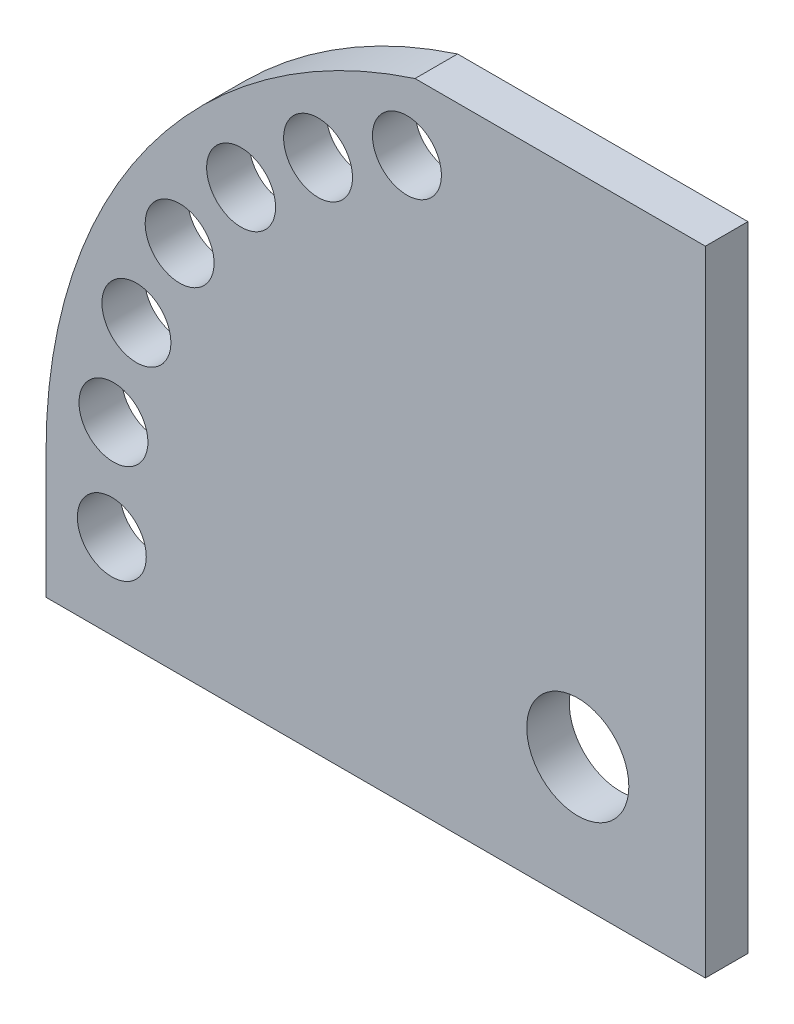
ISO-10303-21;
HEADER;
FILE_DESCRIPTION(('STEP AP214'),'2;1');
FILE_NAME('part.step','',(''),(''),'','','');
FILE_SCHEMA(('AUTOMOTIVE_DESIGN { 1 0 10303 214 1 1 1 1 }'));
ENDSEC;
DATA;
#1=APPLICATION_CONTEXT('core data for automotive mechanical design processes');
#2=APPLICATION_PROTOCOL_DEFINITION('international standard','automotive_design',2000,#1);
#3=PRODUCT_CONTEXT('',#1,'mechanical');
#4=PRODUCT('Part','Part','',(#3));
#5=PRODUCT_RELATED_PRODUCT_CATEGORY('part','',(#4));
#6=PRODUCT_DEFINITION_FORMATION('','',#4);
#7=PRODUCT_DEFINITION_CONTEXT('part definition',#1,'design');
#8=PRODUCT_DEFINITION('design','',#6,#7);
#9=PRODUCT_DEFINITION_SHAPE('','',#8);
#10=(LENGTH_UNIT() NAMED_UNIT(*) SI_UNIT(.MILLI.,.METRE.));
#11=(NAMED_UNIT(*) PLANE_ANGLE_UNIT() SI_UNIT($,.RADIAN.));
#12=(NAMED_UNIT(*) SI_UNIT($,.STERADIAN.) SOLID_ANGLE_UNIT());
#13=UNCERTAINTY_MEASURE_WITH_UNIT(LENGTH_MEASURE(1.E-05),#10,'distance_accuracy_value','');
#14=(GEOMETRIC_REPRESENTATION_CONTEXT(3) GLOBAL_UNCERTAINTY_ASSIGNED_CONTEXT((#13)) GLOBAL_UNIT_ASSIGNED_CONTEXT((#10,
#11,#12)) REPRESENTATION_CONTEXT('',''));
#15=CARTESIAN_POINT('',(0.,0.,0.));
#16=DIRECTION('',(0.,0.,1.));
#17=DIRECTION('',(1.,0.,0.));
#18=AXIS2_PLACEMENT_3D('',#15,#16,#17);
#19=CARTESIAN_POINT('',(15.,-15.,5.));
#20=DIRECTION('',(-1.,0.,0.));
#21=DIRECTION('',(0.,0.,1.));
#22=AXIS2_PLACEMENT_3D('',#19,#20,#21);
#23=PLANE('',#22);
#24=DIRECTION('',(0.,0.,-1.));
#25=VECTOR('',#24,1.);
#26=CARTESIAN_POINT('',(15.,59.5,142.144426609323));
#27=LINE('',#26,#25);
#28=CARTESIAN_POINT('',(15.,59.5,5.));
#29=VERTEX_POINT('',#28);
#30=CARTESIAN_POINT('',(15.,59.5,0.));
#31=VERTEX_POINT('',#30);
#32=EDGE_CURVE('E57',#29,#31,#27,.T.);
#33=ORIENTED_EDGE('',*,*,#32,.F.);
#34=DIRECTION('',(0.,1.,0.));
#35=VECTOR('',#34,1.);
#36=CARTESIAN_POINT('',(15.,-15.,5.));
#37=LINE('',#36,#35);
#38=CARTESIAN_POINT('',(15.,-15.,5.));
#39=VERTEX_POINT('',#38);
#40=EDGE_CURVE('E140',#39,#29,#37,.T.);
#41=ORIENTED_EDGE('',*,*,#40,.F.);
#42=DIRECTION('',(0.,0.,-1.));
#43=VECTOR('',#42,1.);
#44=CARTESIAN_POINT('',(15.,-15.,5.));
#45=LINE('',#44,#43);
#46=CARTESIAN_POINT('',(15.,-15.,0.));
#47=VERTEX_POINT('',#46);
#48=EDGE_CURVE('E143',#39,#47,#45,.T.);
#49=ORIENTED_EDGE('',*,*,#48,.T.);
#50=DIRECTION('',(0.,1.,0.));
#51=VECTOR('',#50,1.);
#52=CARTESIAN_POINT('',(15.,-15.,0.));
#53=LINE('',#52,#51);
#54=EDGE_CURVE('E132',#47,#31,#53,.T.);
#55=ORIENTED_EDGE('',*,*,#54,.T.);
#56=EDGE_LOOP('',(#33,#41,#49,#55));
#57=FACE_BOUND('',#56,.T.);
#58=ADVANCED_FACE('F41',(#57),#23,.F.);
#59=CARTESIAN_POINT('',(0.,0.,5.));
#60=DIRECTION('',(0.,0.,-1.));
#61=DIRECTION('',(-1.,0.,0.));
#62=AXIS2_PLACEMENT_3D('',#59,#60,#61);
#63=PLANE('',#62);
#64=CARTESIAN_POINT('',(-54.5801420142536,6.78292692750806,5.));
#65=DIRECTION('',(0.,0.,1.));
#66=DIRECTION('',(0.977045574435264,-0.213030386274977,0.));
#67=AXIS2_PLACEMENT_3D('',#64,#65,#66);
#68=CIRCLE('',#67,4.05);
#69=CARTESIAN_POINT('',(-50.6231074377907,5.9201538630944,5.));
#70=VERTEX_POINT('',#69);
#71=EDGE_CURVE('E364',#70,#70,#68,.T.);
#72=ORIENTED_EDGE('',*,*,#71,.F.);
#73=EDGE_LOOP('',(#72));
#74=FACE_BOUND('',#73,.T.);
#75=CARTESIAN_POINT('',(-51.8823166636327,18.2544574724791,5.));
#76=DIRECTION('',(0.,0.,1.));
#77=DIRECTION('',(0.909236109047068,-0.416280792260402,0.));
#78=AXIS2_PLACEMENT_3D('',#75,#76,#77);
#79=CIRCLE('',#78,4.05);
#80=CARTESIAN_POINT('',(-48.199910421992,16.5685202638244,5.));
#81=VERTEX_POINT('',#80);
#82=EDGE_CURVE('E390',#81,#81,#79,.T.);
#83=ORIENTED_EDGE('',*,*,#82,.F.);
#84=EDGE_LOOP('',(#83));
#85=FACE_BOUND('',#84,.T.);
#86=CARTESIAN_POINT('',(-46.8026337610488,28.8879468468967,5.));
#87=DIRECTION('',(0.,0.,1.));
#88=DIRECTION('',(0.79968465848709,-0.600420225325885,0.));
#89=AXIS2_PLACEMENT_3D('',#86,#87,#88);
#90=CIRCLE('',#89,4.05);
#91=CARTESIAN_POINT('',(-43.5639108941761,26.4562449343269,5.));
#92=VERTEX_POINT('',#91);
#93=EDGE_CURVE('E399',#92,#92,#90,.T.);
#94=ORIENTED_EDGE('',*,*,#93,.F.);
#95=EDGE_LOOP('',(#94));
#96=FACE_BOUND('',#95,.T.);
#97=CARTESIAN_POINT('',(-39.5742957126618,38.1952237700841,5.));
#98=DIRECTION('',(0.,0.,1.));
#99=DIRECTION('',(0.653420603990104,-0.756995055651758,0.));
#100=AXIS2_PLACEMENT_3D('',#97,#98,#99);
#101=CIRCLE('',#100,4.05);
#102=CARTESIAN_POINT('',(-36.9279422665019,35.1293937946945,5.));
#103=VERTEX_POINT('',#102);
#104=EDGE_CURVE('E409',#103,#103,#101,.T.);
#105=ORIENTED_EDGE('',*,*,#104,.F.);
#106=EDGE_LOOP('',(#105));
#107=FACE_BOUND('',#106,.T.);
#108=CARTESIAN_POINT('',(-30.5291472138484,45.7490018513538,5.));
#109=DIRECTION('',(0.,0.,1.));
#110=DIRECTION('',(0.477158760259606,-0.878817112661967,0.));
#111=AXIS2_PLACEMENT_3D('',#108,#109,#110);
#112=CIRCLE('',#111,4.05);
#113=CARTESIAN_POINT('',(-28.596654234797,42.1897925450728,5.));
#114=VERTEX_POINT('',#113);
#115=EDGE_CURVE('E348',#114,#114,#112,.T.);
#116=ORIENTED_EDGE('',*,*,#115,.F.);
#117=EDGE_LOOP('',(#116));
#118=FACE_BOUND('',#117,.T.);
#119=CARTESIAN_POINT('',(-20.0824406404847,51.2024958173077,5.));
#120=DIRECTION('',(0.,0.,1.));
#121=DIRECTION('',(0.278991106039227,-0.960293685676944,0.));
#122=AXIS2_PLACEMENT_3D('',#119,#120,#121);
#123=CIRCLE('',#122,4.05);
#124=CARTESIAN_POINT('',(-18.9525266610259,47.313306390316,5.));
#125=VERTEX_POINT('',#124);
#126=EDGE_CURVE('E341',#125,#125,#123,.T.);
#127=ORIENTED_EDGE('',*,*,#126,.F.);
#128=EDGE_LOOP('',(#127));
#129=FACE_BOUND('',#128,.T.);
#130=CARTESIAN_POINT('',(-54.7722557505166,-5.00000000000001,5.));
#131=DIRECTION('',(0.,0.,1.));
#132=DIRECTION('',(1.,0.,0.));
#133=AXIS2_PLACEMENT_3D('',#130,#131,#132);
#134=CIRCLE('',#133,4.05);
#135=CARTESIAN_POINT('',(-50.7222557505166,-5.00000000000001,5.));
#136=VERTEX_POINT('',#135);
#137=EDGE_CURVE('E360',#136,#136,#134,.T.);
#138=ORIENTED_EDGE('',*,*,#137,.F.);
#139=EDGE_LOOP('',(#138));
#140=FACE_BOUND('',#139,.T.);
#141=ORIENTED_EDGE('',*,*,#40,.T.);
#142=DIRECTION('',(-1.,0.,0.));
#143=VECTOR('',#142,1.);
#144=CARTESIAN_POINT('',(0.,59.5,5.));
#145=LINE('',#144,#143);
#146=CARTESIAN_POINT('',(-19.131126469709,59.5,5.));
#147=VERTEX_POINT('',#146);
#148=EDGE_CURVE('E64',#29,#147,#145,.T.);
#149=ORIENTED_EDGE('',*,*,#148,.T.);
#150=CARTESIAN_POINT('',(0.,0.,5.));
#151=DIRECTION('',(0.,0.,1.));
#152=DIRECTION('',(-1.,0.,0.));
#153=AXIS2_PLACEMENT_3D('',#150,#151,#152);
#154=CIRCLE('',#153,62.5);
#155=CARTESIAN_POINT('',(-62.5,0.,5.));
#156=VERTEX_POINT('',#155);
#157=EDGE_CURVE('E105',#147,#156,#154,.T.);
#158=ORIENTED_EDGE('',*,*,#157,.T.);
#159=DIRECTION('',(0.,-1.,0.));
#160=VECTOR('',#159,1.);
#161=CARTESIAN_POINT('',(-62.5,0.,5.));
#162=LINE('',#161,#160);
#163=CARTESIAN_POINT('',(-62.5,-15.,5.));
#164=VERTEX_POINT('',#163);
#165=EDGE_CURVE('E131',#156,#164,#162,.T.);
#166=ORIENTED_EDGE('',*,*,#165,.T.);
#167=DIRECTION('',(1.,0.,0.));
#168=VECTOR('',#167,1.);
#169=CARTESIAN_POINT('',(-62.5,-15.,5.));
#170=LINE('',#169,#168);
#171=EDGE_CURVE('E137',#164,#39,#170,.T.);
#172=ORIENTED_EDGE('',*,*,#171,.T.);
#173=EDGE_LOOP('',(#141,#149,#158,#166,#172));
#174=FACE_BOUND('',#173,.T.);
#175=CARTESIAN_POINT('',(0.,0.,5.));
#176=DIRECTION('',(0.,0.,1.));
#177=DIRECTION('',(1.,0.,0.));
#178=AXIS2_PLACEMENT_3D('',#175,#176,#177);
#179=CIRCLE('',#178,6.);
#180=CARTESIAN_POINT('',(6.,0.,5.));
#181=VERTEX_POINT('',#180);
#182=EDGE_CURVE('E101',#181,#181,#179,.T.);
#183=ORIENTED_EDGE('',*,*,#182,.F.);
#184=EDGE_LOOP('',(#183));
#185=FACE_BOUND('',#184,.T.);
#186=ADVANCED_FACE('F166',(#74,#85,#96,#107,#118,#129,#140,#174,#185),#63,.F.);
#187=CARTESIAN_POINT('',(0.,0.,0.));
#188=DIRECTION('',(0.,0.,-1.));
#189=DIRECTION('',(-1.,0.,0.));
#190=AXIS2_PLACEMENT_3D('',#187,#188,#189);
#191=PLANE('',#190);
#192=DIRECTION('',(-1.,0.,0.));
#193=VECTOR('',#192,1.);
#194=CARTESIAN_POINT('',(0.,59.5,0.));
#195=LINE('',#194,#193);
#196=CARTESIAN_POINT('',(-19.131126469709,59.5,0.));
#197=VERTEX_POINT('',#196);
#198=EDGE_CURVE('E12',#31,#197,#195,.T.);
#199=ORIENTED_EDGE('',*,*,#198,.F.);
#200=ORIENTED_EDGE('',*,*,#54,.F.);
#201=DIRECTION('',(1.,0.,0.));
#202=VECTOR('',#201,1.);
#203=CARTESIAN_POINT('',(-62.5,-15.,0.));
#204=LINE('',#203,#202);
#205=CARTESIAN_POINT('',(-62.5,-15.,0.));
#206=VERTEX_POINT('',#205);
#207=EDGE_CURVE('E147',#206,#47,#204,.T.);
#208=ORIENTED_EDGE('',*,*,#207,.F.);
#209=DIRECTION('',(0.,-1.,0.));
#210=VECTOR('',#209,1.);
#211=CARTESIAN_POINT('',(-62.5,0.,0.));
#212=LINE('',#211,#210);
#213=CARTESIAN_POINT('',(-62.5,0.,0.));
#214=VERTEX_POINT('',#213);
#215=EDGE_CURVE('E96',#214,#206,#212,.T.);
#216=ORIENTED_EDGE('',*,*,#215,.F.);
#217=CARTESIAN_POINT('',(0.,0.,0.));
#218=DIRECTION('',(0.,0.,1.));
#219=DIRECTION('',(-1.,0.,0.));
#220=AXIS2_PLACEMENT_3D('',#217,#218,#219);
#221=CIRCLE('',#220,62.5);
#222=EDGE_CURVE('E90',#197,#214,#221,.T.);
#223=ORIENTED_EDGE('',*,*,#222,.F.);
#224=EDGE_LOOP('',(#199,#200,#208,#216,#223));
#225=FACE_BOUND('',#224,.T.);
#226=CARTESIAN_POINT('',(-54.5801420142536,6.78292692750806,0.));
#227=DIRECTION('',(0.,0.,1.));
#228=DIRECTION('',(0.977045574435264,-0.213030386274977,0.));
#229=AXIS2_PLACEMENT_3D('',#226,#227,#228);
#230=CIRCLE('',#229,4.05);
#231=CARTESIAN_POINT('',(-50.6231074377907,5.9201538630944,0.));
#232=VERTEX_POINT('',#231);
#233=EDGE_CURVE('E118',#232,#232,#230,.T.);
#234=ORIENTED_EDGE('',*,*,#233,.T.);
#235=EDGE_LOOP('',(#234));
#236=FACE_BOUND('',#235,.T.);
#237=CARTESIAN_POINT('',(-51.8823166636327,18.2544574724791,0.));
#238=DIRECTION('',(0.,0.,1.));
#239=DIRECTION('',(0.909236109047068,-0.416280792260402,0.));
#240=AXIS2_PLACEMENT_3D('',#237,#238,#239);
#241=CIRCLE('',#240,4.05);
#242=CARTESIAN_POINT('',(-48.199910421992,16.5685202638244,0.));
#243=VERTEX_POINT('',#242);
#244=EDGE_CURVE('E394',#243,#243,#241,.T.);
#245=ORIENTED_EDGE('',*,*,#244,.T.);
#246=EDGE_LOOP('',(#245));
#247=FACE_BOUND('',#246,.T.);
#248=CARTESIAN_POINT('',(-46.8026337610488,28.8879468468967,0.));
#249=DIRECTION('',(0.,0.,1.));
#250=DIRECTION('',(0.79968465848709,-0.600420225325885,0.));
#251=AXIS2_PLACEMENT_3D('',#248,#249,#250);
#252=CIRCLE('',#251,4.05);
#253=CARTESIAN_POINT('',(-43.5639108941761,26.4562449343269,0.));
#254=VERTEX_POINT('',#253);
#255=EDGE_CURVE('E404',#254,#254,#252,.T.);
#256=ORIENTED_EDGE('',*,*,#255,.T.);
#257=EDGE_LOOP('',(#256));
#258=FACE_BOUND('',#257,.T.);
#259=CARTESIAN_POINT('',(-39.5742957126618,38.1952237700841,0.));
#260=DIRECTION('',(0.,0.,1.));
#261=DIRECTION('',(0.653420603990104,-0.756995055651758,0.));
#262=AXIS2_PLACEMENT_3D('',#259,#260,#261);
#263=CIRCLE('',#262,4.05);
#264=CARTESIAN_POINT('',(-36.9279422665019,35.1293937946945,0.));
#265=VERTEX_POINT('',#264);
#266=EDGE_CURVE('E414',#265,#265,#263,.T.);
#267=ORIENTED_EDGE('',*,*,#266,.T.);
#268=EDGE_LOOP('',(#267));
#269=FACE_BOUND('',#268,.T.);
#270=CARTESIAN_POINT('',(-30.5291472138484,45.7490018513538,0.));
#271=DIRECTION('',(0.,0.,1.));
#272=DIRECTION('',(0.477158760259606,-0.878817112661967,0.));
#273=AXIS2_PLACEMENT_3D('',#270,#271,#272);
#274=CIRCLE('',#273,4.05);
#275=CARTESIAN_POINT('',(-28.596654234797,42.1897925450728,0.));
#276=VERTEX_POINT('',#275);
#277=EDGE_CURVE('E343',#276,#276,#274,.T.);
#278=ORIENTED_EDGE('',*,*,#277,.T.);
#279=EDGE_LOOP('',(#278));
#280=FACE_BOUND('',#279,.T.);
#281=CARTESIAN_POINT('',(-20.0824406404847,51.2024958173077,0.));
#282=DIRECTION('',(0.,0.,1.));
#283=DIRECTION('',(0.278991106039227,-0.960293685676944,0.));
#284=AXIS2_PLACEMENT_3D('',#281,#282,#283);
#285=CIRCLE('',#284,4.05);
#286=CARTESIAN_POINT('',(-18.9525266610259,47.313306390316,0.));
#287=VERTEX_POINT('',#286);
#288=EDGE_CURVE('E117',#287,#287,#285,.T.);
#289=ORIENTED_EDGE('',*,*,#288,.T.);
#290=EDGE_LOOP('',(#289));
#291=FACE_BOUND('',#290,.T.);
#292=CARTESIAN_POINT('',(-54.7722557505166,-5.00000000000001,0.));
#293=DIRECTION('',(0.,0.,1.));
#294=DIRECTION('',(1.,0.,0.));
#295=AXIS2_PLACEMENT_3D('',#292,#293,#294);
#296=CIRCLE('',#295,4.05);
#297=CARTESIAN_POINT('',(-50.7222557505166,-5.00000000000001,0.));
#298=VERTEX_POINT('',#297);
#299=EDGE_CURVE('E355',#298,#298,#296,.T.);
#300=ORIENTED_EDGE('',*,*,#299,.T.);
#301=EDGE_LOOP('',(#300));
#302=FACE_BOUND('',#301,.T.);
#303=CARTESIAN_POINT('',(0.,0.,0.));
#304=DIRECTION('',(0.,0.,1.));
#305=DIRECTION('',(1.,0.,0.));
#306=AXIS2_PLACEMENT_3D('',#303,#304,#305);
#307=CIRCLE('',#306,6.);
#308=CARTESIAN_POINT('',(6.,0.,0.));
#309=VERTEX_POINT('',#308);
#310=EDGE_CURVE('E133',#309,#309,#307,.T.);
#311=ORIENTED_EDGE('',*,*,#310,.T.);
#312=EDGE_LOOP('',(#311));
#313=FACE_BOUND('',#312,.T.);
#314=ADVANCED_FACE('F92',(#225,#236,#247,#258,#269,#280,#291,#302,#313),#191,.T.);
#315=CARTESIAN_POINT('',(0.,0.,5.));
#316=DIRECTION('',(0.,0.,-1.));
#317=DIRECTION('',(-1.,0.,0.));
#318=AXIS2_PLACEMENT_3D('',#315,#316,#317);
#319=CYLINDRICAL_SURFACE('',#318,62.5);
#320=ORIENTED_EDGE('',*,*,#157,.F.);
#321=DIRECTION('',(0.,0.,-1.));
#322=VECTOR('',#321,1.);
#323=CARTESIAN_POINT('',(-19.131126469709,59.5,142.144426609323));
#324=LINE('',#323,#322);
#325=EDGE_CURVE('E104',#147,#197,#324,.T.);
#326=ORIENTED_EDGE('',*,*,#325,.T.);
#327=ORIENTED_EDGE('',*,*,#222,.T.);
#328=DIRECTION('',(0.,0.,-1.));
#329=VECTOR('',#328,1.);
#330=CARTESIAN_POINT('',(-62.5,0.,5.));
#331=LINE('',#330,#329);
#332=EDGE_CURVE('E50',#156,#214,#331,.T.);
#333=ORIENTED_EDGE('',*,*,#332,.F.);
#334=EDGE_LOOP('',(#320,#326,#327,#333));
#335=FACE_BOUND('',#334,.T.);
#336=ADVANCED_FACE('F43',(#335),#319,.T.);
#337=CARTESIAN_POINT('',(-62.5,0.,5.));
#338=DIRECTION('',(1.,0.,0.));
#339=DIRECTION('',(0.,0.,-1.));
#340=AXIS2_PLACEMENT_3D('',#337,#338,#339);
#341=PLANE('',#340);
#342=ORIENTED_EDGE('',*,*,#215,.T.);
#343=DIRECTION('',(0.,0.,-1.));
#344=VECTOR('',#343,1.);
#345=CARTESIAN_POINT('',(-62.5,-15.,5.));
#346=LINE('',#345,#344);
#347=EDGE_CURVE('E155',#164,#206,#346,.T.);
#348=ORIENTED_EDGE('',*,*,#347,.F.);
#349=ORIENTED_EDGE('',*,*,#165,.F.);
#350=ORIENTED_EDGE('',*,*,#332,.T.);
#351=EDGE_LOOP('',(#342,#348,#349,#350));
#352=FACE_BOUND('',#351,.T.);
#353=ADVANCED_FACE('F163',(#352),#341,.F.);
#354=CARTESIAN_POINT('',(-62.5,-15.,5.));
#355=DIRECTION('',(0.,1.,0.));
#356=DIRECTION('',(0.,0.,1.));
#357=AXIS2_PLACEMENT_3D('',#354,#355,#356);
#358=PLANE('',#357);
#359=ORIENTED_EDGE('',*,*,#207,.T.);
#360=ORIENTED_EDGE('',*,*,#48,.F.);
#361=ORIENTED_EDGE('',*,*,#171,.F.);
#362=ORIENTED_EDGE('',*,*,#347,.T.);
#363=EDGE_LOOP('',(#359,#360,#361,#362));
#364=FACE_BOUND('',#363,.T.);
#365=ADVANCED_FACE('F170',(#364),#358,.F.);
#366=CARTESIAN_POINT('',(0.,0.,5.));
#367=DIRECTION('',(0.,0.,-1.));
#368=DIRECTION('',(-1.,0.,0.));
#369=AXIS2_PLACEMENT_3D('',#366,#367,#368);
#370=CYLINDRICAL_SURFACE('',#369,6.);
#371=ORIENTED_EDGE('',*,*,#182,.T.);
#372=EDGE_LOOP('',(#371));
#373=FACE_BOUND('',#372,.T.);
#374=ORIENTED_EDGE('',*,*,#310,.F.);
#375=EDGE_LOOP('',(#374));
#376=FACE_BOUND('',#375,.T.);
#377=ADVANCED_FACE('F181',(#373,#376),#370,.F.);
#378=CARTESIAN_POINT('',(-54.7722557505166,-5.00000000000001,0.));
#379=DIRECTION('',(0.,0.,1.));
#380=DIRECTION('',(1.,0.,0.));
#381=AXIS2_PLACEMENT_3D('',#378,#379,#380);
#382=CYLINDRICAL_SURFACE('',#381,4.05);
#383=ORIENTED_EDGE('',*,*,#299,.F.);
#384=EDGE_LOOP('',(#383));
#385=FACE_BOUND('',#384,.T.);
#386=ORIENTED_EDGE('',*,*,#137,.T.);
#387=EDGE_LOOP('',(#386));
#388=FACE_BOUND('',#387,.T.);
#389=ADVANCED_FACE('F229',(#385,#388),#382,.F.);
#390=CARTESIAN_POINT('',(-20.0824406404847,51.2024958173077,0.));
#391=DIRECTION('',(0.,0.,1.));
#392=DIRECTION('',(0.278991106039227,-0.960293685676944,0.));
#393=AXIS2_PLACEMENT_3D('',#390,#391,#392);
#394=CYLINDRICAL_SURFACE('',#393,4.05);
#395=ORIENTED_EDGE('',*,*,#288,.F.);
#396=EDGE_LOOP('',(#395));
#397=FACE_BOUND('',#396,.T.);
#398=ORIENTED_EDGE('',*,*,#126,.T.);
#399=EDGE_LOOP('',(#398));
#400=FACE_BOUND('',#399,.T.);
#401=ADVANCED_FACE('F238',(#397,#400),#394,.F.);
#402=CARTESIAN_POINT('',(-30.5291472138484,45.7490018513538,0.));
#403=DIRECTION('',(0.,0.,1.));
#404=DIRECTION('',(0.477158760259606,-0.878817112661967,0.));
#405=AXIS2_PLACEMENT_3D('',#402,#403,#404);
#406=CYLINDRICAL_SURFACE('',#405,4.05);
#407=ORIENTED_EDGE('',*,*,#277,.F.);
#408=EDGE_LOOP('',(#407));
#409=FACE_BOUND('',#408,.T.);
#410=ORIENTED_EDGE('',*,*,#115,.T.);
#411=EDGE_LOOP('',(#410));
#412=FACE_BOUND('',#411,.T.);
#413=ADVANCED_FACE('F275',(#409,#412),#406,.F.);
#414=CARTESIAN_POINT('',(-39.5742957126618,38.1952237700841,0.));
#415=DIRECTION('',(0.,0.,1.));
#416=DIRECTION('',(0.653420603990104,-0.756995055651758,0.));
#417=AXIS2_PLACEMENT_3D('',#414,#415,#416);
#418=CYLINDRICAL_SURFACE('',#417,4.05);
#419=ORIENTED_EDGE('',*,*,#266,.F.);
#420=EDGE_LOOP('',(#419));
#421=FACE_BOUND('',#420,.T.);
#422=ORIENTED_EDGE('',*,*,#104,.T.);
#423=EDGE_LOOP('',(#422));
#424=FACE_BOUND('',#423,.T.);
#425=ADVANCED_FACE('F266',(#421,#424),#418,.F.);
#426=CARTESIAN_POINT('',(-46.8026337610488,28.8879468468967,0.));
#427=DIRECTION('',(0.,0.,1.));
#428=DIRECTION('',(0.79968465848709,-0.600420225325885,0.));
#429=AXIS2_PLACEMENT_3D('',#426,#427,#428);
#430=CYLINDRICAL_SURFACE('',#429,4.05);
#431=ORIENTED_EDGE('',*,*,#255,.F.);
#432=EDGE_LOOP('',(#431));
#433=FACE_BOUND('',#432,.T.);
#434=ORIENTED_EDGE('',*,*,#93,.T.);
#435=EDGE_LOOP('',(#434));
#436=FACE_BOUND('',#435,.T.);
#437=ADVANCED_FACE('F257',(#433,#436),#430,.F.);
#438=CARTESIAN_POINT('',(-51.8823166636327,18.2544574724791,0.));
#439=DIRECTION('',(0.,0.,1.));
#440=DIRECTION('',(0.909236109047068,-0.416280792260402,0.));
#441=AXIS2_PLACEMENT_3D('',#438,#439,#440);
#442=CYLINDRICAL_SURFACE('',#441,4.05);
#443=ORIENTED_EDGE('',*,*,#244,.F.);
#444=EDGE_LOOP('',(#443));
#445=FACE_BOUND('',#444,.T.);
#446=ORIENTED_EDGE('',*,*,#82,.T.);
#447=EDGE_LOOP('',(#446));
#448=FACE_BOUND('',#447,.T.);
#449=ADVANCED_FACE('F248',(#445,#448),#442,.F.);
#450=CARTESIAN_POINT('',(-54.5801420142536,6.78292692750806,0.));
#451=DIRECTION('',(0.,0.,1.));
#452=DIRECTION('',(0.977045574435264,-0.213030386274977,0.));
#453=AXIS2_PLACEMENT_3D('',#450,#451,#452);
#454=CYLINDRICAL_SURFACE('',#453,4.05);
#455=ORIENTED_EDGE('',*,*,#233,.F.);
#456=EDGE_LOOP('',(#455));
#457=FACE_BOUND('',#456,.T.);
#458=ORIENTED_EDGE('',*,*,#71,.T.);
#459=EDGE_LOOP('',(#458));
#460=FACE_BOUND('',#459,.T.);
#461=ADVANCED_FACE('F244',(#457,#460),#454,.F.);
#462=CARTESIAN_POINT('',(15.,59.5,142.144426609323));
#463=DIRECTION('',(0.,-1.,0.));
#464=DIRECTION('',(1.,0.,0.));
#465=AXIS2_PLACEMENT_3D('',#462,#463,#464);
#466=PLANE('',#465);
#467=ORIENTED_EDGE('',*,*,#148,.F.);
#468=ORIENTED_EDGE('',*,*,#32,.T.);
#469=ORIENTED_EDGE('',*,*,#198,.T.);
#470=ORIENTED_EDGE('',*,*,#325,.F.);
#471=EDGE_LOOP('',(#467,#468,#469,#470));
#472=FACE_BOUND('',#471,.T.);
#473=ADVANCED_FACE('F109',(#472),#466,.F.);
#474=CLOSED_SHELL('',(#58,#186,#314,#336,#353,#365,#377,#389,#401,#413,#425,#437,#449,#461,#473));
#475=MANIFOLD_SOLID_BREP('B2',#474);
#476=ADVANCED_BREP_SHAPE_REPRESENTATION('',(#18,#475),#14);
#477=SHAPE_DEFINITION_REPRESENTATION(#9,#476);
ENDSEC;
END-ISO-10303-21;
